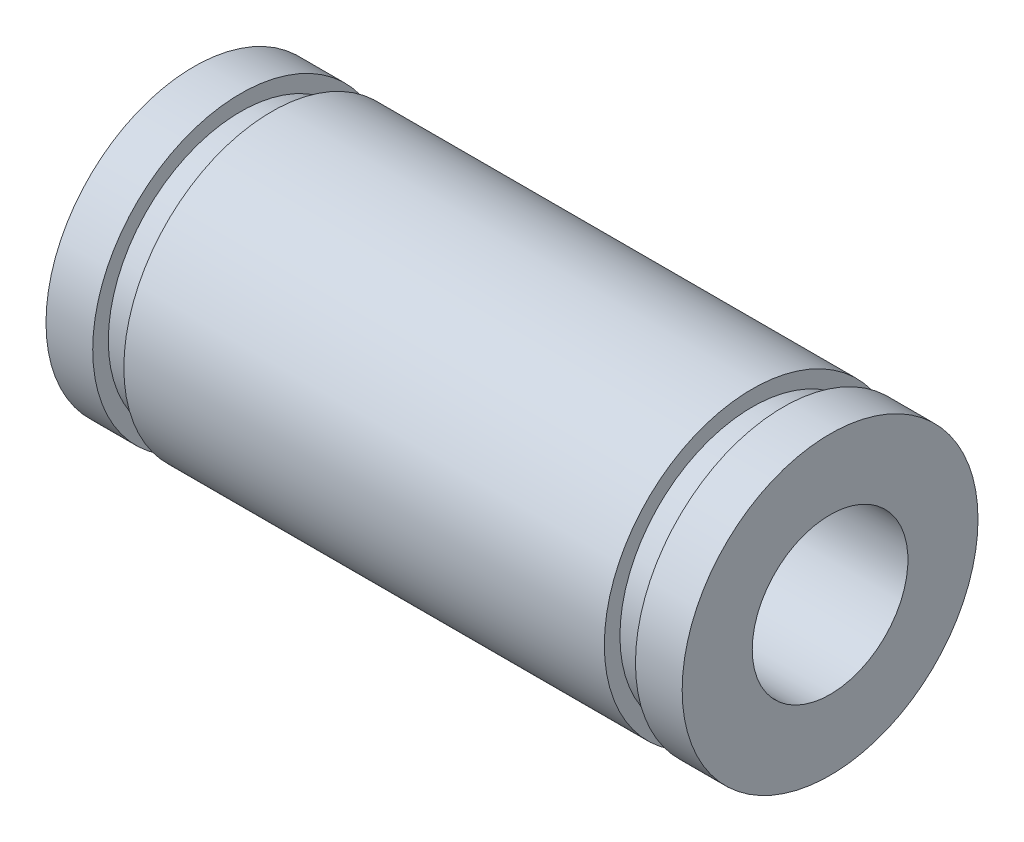
ISO-10303-21;
HEADER;
FILE_DESCRIPTION(('STEP AP214'),'2;1');
FILE_NAME('part.step','',(''),(''),'','','');
FILE_SCHEMA(('AUTOMOTIVE_DESIGN { 1 0 10303 214 1 1 1 1 }'));
ENDSEC;
DATA;
#1=APPLICATION_CONTEXT('core data for automotive mechanical design processes');
#2=APPLICATION_PROTOCOL_DEFINITION('international standard','automotive_design',2000,#1);
#3=PRODUCT_CONTEXT('',#1,'mechanical');
#4=PRODUCT('Part','Part','',(#3));
#5=PRODUCT_RELATED_PRODUCT_CATEGORY('part','',(#4));
#6=PRODUCT_DEFINITION_FORMATION('','',#4);
#7=PRODUCT_DEFINITION_CONTEXT('part definition',#1,'design');
#8=PRODUCT_DEFINITION('design','',#6,#7);
#9=PRODUCT_DEFINITION_SHAPE('','',#8);
#10=(LENGTH_UNIT() NAMED_UNIT(*) SI_UNIT(.MILLI.,.METRE.));
#11=(NAMED_UNIT(*) PLANE_ANGLE_UNIT() SI_UNIT($,.RADIAN.));
#12=(NAMED_UNIT(*) SI_UNIT($,.STERADIAN.) SOLID_ANGLE_UNIT());
#13=UNCERTAINTY_MEASURE_WITH_UNIT(LENGTH_MEASURE(1.E-05),#10,'distance_accuracy_value','');
#14=(GEOMETRIC_REPRESENTATION_CONTEXT(3) GLOBAL_UNCERTAINTY_ASSIGNED_CONTEXT((#13)) GLOBAL_UNIT_ASSIGNED_CONTEXT((#10,
#11,#12)) REPRESENTATION_CONTEXT('',''));
#15=CARTESIAN_POINT('',(0.,0.,0.));
#16=DIRECTION('',(0.,0.,1.));
#17=DIRECTION('',(1.,0.,0.));
#18=AXIS2_PLACEMENT_3D('',#15,#16,#17);
#19=CARTESIAN_POINT('',(-17.9538077616177,9.5,0.));
#20=DIRECTION('',(1.,0.,0.));
#21=DIRECTION('',(0.,0.,-1.));
#22=AXIS2_PLACEMENT_3D('',#19,#20,#21);
#23=PLANE('',#22);
#24=CARTESIAN_POINT('',(-17.9538077616177,0.,0.));
#25=DIRECTION('',(-1.,0.,0.));
#26=DIRECTION('',(0.,0.,1.));
#27=AXIS2_PLACEMENT_3D('',#24,#25,#26);
#28=CIRCLE('',#27,5.);
#29=CARTESIAN_POINT('',(-17.9538077616177,0.,5.));
#30=VERTEX_POINT('',#29);
#31=EDGE_CURVE('E10',#30,#30,#28,.T.);
#32=ORIENTED_EDGE('',*,*,#31,.F.);
#33=EDGE_LOOP('',(#32));
#34=FACE_BOUND('',#33,.T.);
#35=CARTESIAN_POINT('',(-17.9538077616177,0.,0.));
#36=DIRECTION('',(-1.,0.,0.));
#37=DIRECTION('',(0.,0.,1.));
#38=AXIS2_PLACEMENT_3D('',#35,#36,#37);
#39=CIRCLE('',#38,9.5);
#40=CARTESIAN_POINT('',(-17.9538077616177,0.,9.5));
#41=VERTEX_POINT('',#40);
#42=EDGE_CURVE('E71',#41,#41,#39,.T.);
#43=ORIENTED_EDGE('',*,*,#42,.T.);
#44=EDGE_LOOP('',(#43));
#45=FACE_BOUND('',#44,.T.);
#46=ADVANCED_FACE('F31',(#34,#45),#23,.F.);
#47=CARTESIAN_POINT('',(-38.7537700950734,0.,0.));
#48=DIRECTION('',(-1.,0.,0.));
#49=DIRECTION('',(0.,0.,1.));
#50=AXIS2_PLACEMENT_3D('',#47,#48,#49);
#51=CYLINDRICAL_SURFACE('',#50,5.);
#52=CARTESIAN_POINT('',(22.9050978797089,0.,0.));
#53=DIRECTION('',(-1.,0.,0.));
#54=DIRECTION('',(0.,0.,1.));
#55=AXIS2_PLACEMENT_3D('',#52,#53,#54);
#56=CIRCLE('',#55,5.);
#57=CARTESIAN_POINT('',(22.9050978797089,0.,5.));
#58=VERTEX_POINT('',#57);
#59=EDGE_CURVE('E37',#58,#58,#56,.T.);
#60=ORIENTED_EDGE('',*,*,#59,.F.);
#61=EDGE_LOOP('',(#60));
#62=FACE_BOUND('',#61,.T.);
#63=ORIENTED_EDGE('',*,*,#31,.T.);
#64=EDGE_LOOP('',(#63));
#65=FACE_BOUND('',#64,.T.);
#66=ADVANCED_FACE('F132',(#62,#65),#51,.F.);
#67=CARTESIAN_POINT('',(22.9050978797089,9.5,0.));
#68=DIRECTION('',(-1.,0.,0.));
#69=DIRECTION('',(0.,0.,1.));
#70=AXIS2_PLACEMENT_3D('',#67,#68,#69);
#71=PLANE('',#70);
#72=CARTESIAN_POINT('',(22.9050978797089,0.,0.));
#73=DIRECTION('',(-1.,0.,0.));
#74=DIRECTION('',(0.,0.,1.));
#75=AXIS2_PLACEMENT_3D('',#72,#73,#74);
#76=CIRCLE('',#75,9.5);
#77=CARTESIAN_POINT('',(22.9050978797089,0.,9.5));
#78=VERTEX_POINT('',#77);
#79=EDGE_CURVE('E41',#78,#78,#76,.T.);
#80=ORIENTED_EDGE('',*,*,#79,.F.);
#81=EDGE_LOOP('',(#80));
#82=FACE_BOUND('',#81,.T.);
#83=ORIENTED_EDGE('',*,*,#59,.T.);
#84=EDGE_LOOP('',(#83));
#85=FACE_BOUND('',#84,.T.);
#86=ADVANCED_FACE('F127',(#82,#85),#71,.F.);
#87=CARTESIAN_POINT('',(-38.7537700950734,0.,0.));
#88=DIRECTION('',(-1.,0.,0.));
#89=DIRECTION('',(0.,0.,1.));
#90=AXIS2_PLACEMENT_3D('',#87,#88,#89);
#91=CYLINDRICAL_SURFACE('',#90,9.5);
#92=CARTESIAN_POINT('',(19.9050978797089,0.,0.));
#93=DIRECTION('',(-1.,0.,0.));
#94=DIRECTION('',(0.,0.,1.));
#95=AXIS2_PLACEMENT_3D('',#92,#93,#94);
#96=CIRCLE('',#95,9.5);
#97=CARTESIAN_POINT('',(19.9050978797089,0.,9.5));
#98=VERTEX_POINT('',#97);
#99=EDGE_CURVE('E45',#98,#98,#96,.T.);
#100=ORIENTED_EDGE('',*,*,#99,.F.);
#101=EDGE_LOOP('',(#100));
#102=FACE_BOUND('',#101,.T.);
#103=ORIENTED_EDGE('',*,*,#79,.T.);
#104=EDGE_LOOP('',(#103));
#105=FACE_BOUND('',#104,.T.);
#106=ADVANCED_FACE('F121',(#102,#105),#91,.T.);
#107=CARTESIAN_POINT('',(19.9050978797089,8.49759178388415,0.));
#108=DIRECTION('',(1.,0.,0.));
#109=DIRECTION('',(0.,0.,-1.));
#110=AXIS2_PLACEMENT_3D('',#107,#108,#109);
#111=PLANE('',#110);
#112=CARTESIAN_POINT('',(19.9050978797089,0.,0.));
#113=DIRECTION('',(-1.,0.,0.));
#114=DIRECTION('',(0.,0.,1.));
#115=AXIS2_PLACEMENT_3D('',#112,#113,#114);
#116=CIRCLE('',#115,8.49759178388415);
#117=CARTESIAN_POINT('',(19.9050978797089,0.,8.49759178388415));
#118=VERTEX_POINT('',#117);
#119=EDGE_CURVE('E50',#118,#118,#116,.T.);
#120=ORIENTED_EDGE('',*,*,#119,.F.);
#121=EDGE_LOOP('',(#120));
#122=FACE_BOUND('',#121,.T.);
#123=ORIENTED_EDGE('',*,*,#99,.T.);
#124=EDGE_LOOP('',(#123));
#125=FACE_BOUND('',#124,.T.);
#126=ADVANCED_FACE('F115',(#122,#125),#111,.F.);
#127=CARTESIAN_POINT('',(-38.7537700950734,0.,0.));
#128=DIRECTION('',(-1.,0.,0.));
#129=DIRECTION('',(0.,0.,1.));
#130=AXIS2_PLACEMENT_3D('',#127,#128,#129);
#131=CYLINDRICAL_SURFACE('',#130,8.49759178388415);
#132=CARTESIAN_POINT('',(17.9050978797089,0.,0.));
#133=DIRECTION('',(-1.,0.,0.));
#134=DIRECTION('',(0.,0.,1.));
#135=AXIS2_PLACEMENT_3D('',#132,#133,#134);
#136=CIRCLE('',#135,8.49759178388415);
#137=CARTESIAN_POINT('',(17.9050978797089,0.,8.49759178388415));
#138=VERTEX_POINT('',#137);
#139=EDGE_CURVE('E53',#138,#138,#136,.T.);
#140=ORIENTED_EDGE('',*,*,#139,.F.);
#141=EDGE_LOOP('',(#140));
#142=FACE_BOUND('',#141,.T.);
#143=ORIENTED_EDGE('',*,*,#119,.T.);
#144=EDGE_LOOP('',(#143));
#145=FACE_BOUND('',#144,.T.);
#146=ADVANCED_FACE('F109',(#142,#145),#131,.T.);
#147=CARTESIAN_POINT('',(17.9050978797089,9.5,0.));
#148=DIRECTION('',(-1.,0.,0.));
#149=DIRECTION('',(0.,0.,1.));
#150=AXIS2_PLACEMENT_3D('',#147,#148,#149);
#151=PLANE('',#150);
#152=CARTESIAN_POINT('',(17.9050978797089,0.,0.));
#153=DIRECTION('',(-1.,0.,0.));
#154=DIRECTION('',(0.,0.,1.));
#155=AXIS2_PLACEMENT_3D('',#152,#153,#154);
#156=CIRCLE('',#155,9.5);
#157=CARTESIAN_POINT('',(17.9050978797089,0.,9.5));
#158=VERTEX_POINT('',#157);
#159=EDGE_CURVE('E56',#158,#158,#156,.T.);
#160=ORIENTED_EDGE('',*,*,#159,.F.);
#161=EDGE_LOOP('',(#160));
#162=FACE_BOUND('',#161,.T.);
#163=ORIENTED_EDGE('',*,*,#139,.T.);
#164=EDGE_LOOP('',(#163));
#165=FACE_BOUND('',#164,.T.);
#166=ADVANCED_FACE('F103',(#162,#165),#151,.F.);
#167=CARTESIAN_POINT('',(-38.7537700950734,0.,0.));
#168=DIRECTION('',(-1.,0.,0.));
#169=DIRECTION('',(0.,0.,1.));
#170=AXIS2_PLACEMENT_3D('',#167,#168,#169);
#171=CYLINDRICAL_SURFACE('',#170,9.5);
#172=CARTESIAN_POINT('',(-12.9538077616177,0.,0.));
#173=DIRECTION('',(-1.,0.,0.));
#174=DIRECTION('',(0.,0.,1.));
#175=AXIS2_PLACEMENT_3D('',#172,#173,#174);
#176=CIRCLE('',#175,9.5);
#177=CARTESIAN_POINT('',(-12.9538077616177,0.,9.5));
#178=VERTEX_POINT('',#177);
#179=EDGE_CURVE('E59',#178,#178,#176,.T.);
#180=ORIENTED_EDGE('',*,*,#179,.F.);
#181=EDGE_LOOP('',(#180));
#182=FACE_BOUND('',#181,.T.);
#183=ORIENTED_EDGE('',*,*,#159,.T.);
#184=EDGE_LOOP('',(#183));
#185=FACE_BOUND('',#184,.T.);
#186=ADVANCED_FACE('F97',(#182,#185),#171,.T.);
#187=CARTESIAN_POINT('',(-12.9538077616177,8.49759178388415,0.));
#188=DIRECTION('',(1.,0.,0.));
#189=DIRECTION('',(0.,0.,-1.));
#190=AXIS2_PLACEMENT_3D('',#187,#188,#189);
#191=PLANE('',#190);
#192=CARTESIAN_POINT('',(-12.9538077616177,0.,0.));
#193=DIRECTION('',(-1.,0.,0.));
#194=DIRECTION('',(0.,0.,1.));
#195=AXIS2_PLACEMENT_3D('',#192,#193,#194);
#196=CIRCLE('',#195,8.49759178388415);
#197=CARTESIAN_POINT('',(-12.9538077616177,0.,8.49759178388415));
#198=VERTEX_POINT('',#197);
#199=EDGE_CURVE('E62',#198,#198,#196,.T.);
#200=ORIENTED_EDGE('',*,*,#199,.F.);
#201=EDGE_LOOP('',(#200));
#202=FACE_BOUND('',#201,.T.);
#203=ORIENTED_EDGE('',*,*,#179,.T.);
#204=EDGE_LOOP('',(#203));
#205=FACE_BOUND('',#204,.T.);
#206=ADVANCED_FACE('F91',(#202,#205),#191,.F.);
#207=CARTESIAN_POINT('',(-38.7537700950734,0.,0.));
#208=DIRECTION('',(-1.,0.,0.));
#209=DIRECTION('',(0.,0.,1.));
#210=AXIS2_PLACEMENT_3D('',#207,#208,#209);
#211=CYLINDRICAL_SURFACE('',#210,8.49759178388415);
#212=CARTESIAN_POINT('',(-14.9538077616177,0.,0.));
#213=DIRECTION('',(-1.,0.,0.));
#214=DIRECTION('',(0.,0.,1.));
#215=AXIS2_PLACEMENT_3D('',#212,#213,#214);
#216=CIRCLE('',#215,8.49759178388415);
#217=CARTESIAN_POINT('',(-14.9538077616177,0.,8.49759178388415));
#218=VERTEX_POINT('',#217);
#219=EDGE_CURVE('E65',#218,#218,#216,.T.);
#220=ORIENTED_EDGE('',*,*,#219,.F.);
#221=EDGE_LOOP('',(#220));
#222=FACE_BOUND('',#221,.T.);
#223=ORIENTED_EDGE('',*,*,#199,.T.);
#224=EDGE_LOOP('',(#223));
#225=FACE_BOUND('',#224,.T.);
#226=ADVANCED_FACE('F85',(#222,#225),#211,.T.);
#227=CARTESIAN_POINT('',(-14.9538077616177,9.5,0.));
#228=DIRECTION('',(-1.,0.,0.));
#229=DIRECTION('',(0.,0.,1.));
#230=AXIS2_PLACEMENT_3D('',#227,#228,#229);
#231=PLANE('',#230);
#232=CARTESIAN_POINT('',(-14.9538077616177,0.,0.));
#233=DIRECTION('',(-1.,0.,0.));
#234=DIRECTION('',(0.,0.,1.));
#235=AXIS2_PLACEMENT_3D('',#232,#233,#234);
#236=CIRCLE('',#235,9.5);
#237=CARTESIAN_POINT('',(-14.9538077616177,0.,9.5));
#238=VERTEX_POINT('',#237);
#239=EDGE_CURVE('E68',#238,#238,#236,.T.);
#240=ORIENTED_EDGE('',*,*,#239,.F.);
#241=EDGE_LOOP('',(#240));
#242=FACE_BOUND('',#241,.T.);
#243=ORIENTED_EDGE('',*,*,#219,.T.);
#244=EDGE_LOOP('',(#243));
#245=FACE_BOUND('',#244,.T.);
#246=ADVANCED_FACE('F79',(#242,#245),#231,.F.);
#247=CARTESIAN_POINT('',(-38.7537700950734,0.,0.));
#248=DIRECTION('',(-1.,0.,0.));
#249=DIRECTION('',(0.,0.,1.));
#250=AXIS2_PLACEMENT_3D('',#247,#248,#249);
#251=CYLINDRICAL_SURFACE('',#250,9.5);
#252=ORIENTED_EDGE('',*,*,#42,.F.);
#253=EDGE_LOOP('',(#252));
#254=FACE_BOUND('',#253,.T.);
#255=ORIENTED_EDGE('',*,*,#239,.T.);
#256=EDGE_LOOP('',(#255));
#257=FACE_BOUND('',#256,.T.);
#258=ADVANCED_FACE('F76',(#254,#257),#251,.T.);
#259=CLOSED_SHELL('',(#46,#66,#86,#106,#126,#146,#166,#186,#206,#226,#246,#258));
#260=MANIFOLD_SOLID_BREP('B2',#259);
#261=ADVANCED_BREP_SHAPE_REPRESENTATION('',(#18,#260),#14);
#262=SHAPE_DEFINITION_REPRESENTATION(#9,#261);
ENDSEC;
END-ISO-10303-21;
